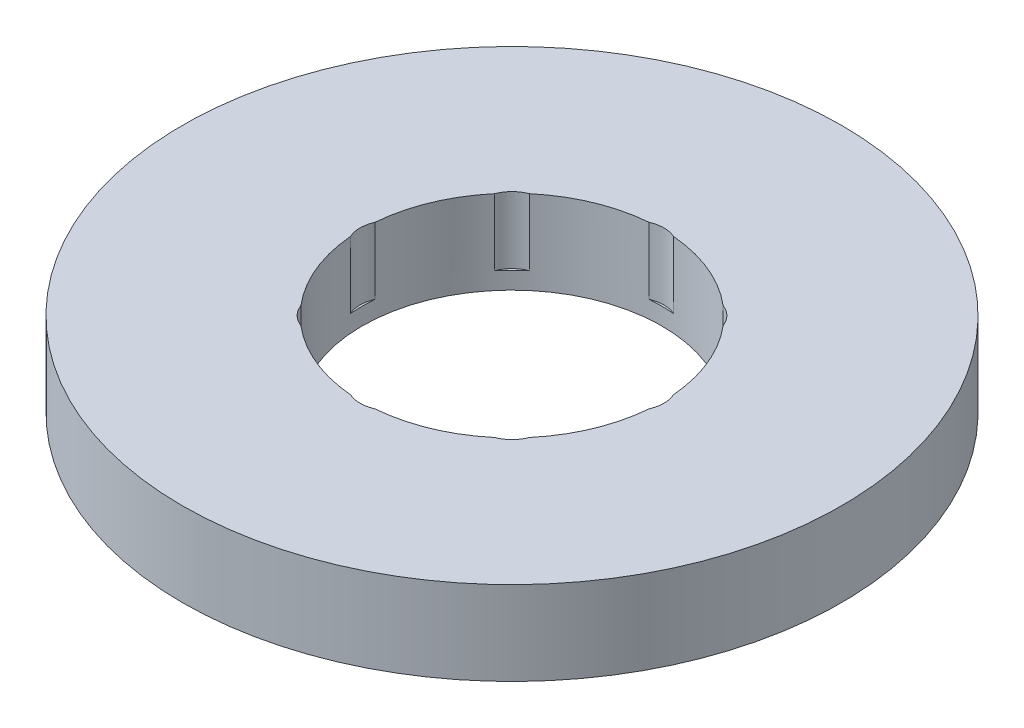
ISO-10303-21;
HEADER;
FILE_DESCRIPTION(('STEP AP214'),'2;1');
FILE_NAME('part.step','',(''),(''),'','','');
FILE_SCHEMA(('AUTOMOTIVE_DESIGN { 1 0 10303 214 1 1 1 1 }'));
ENDSEC;
DATA;
#1=APPLICATION_CONTEXT('core data for automotive mechanical design processes');
#2=APPLICATION_PROTOCOL_DEFINITION('international standard','automotive_design',2000,#1);
#3=PRODUCT_CONTEXT('',#1,'mechanical');
#4=PRODUCT('Part','Part','',(#3));
#5=PRODUCT_RELATED_PRODUCT_CATEGORY('part','',(#4));
#6=PRODUCT_DEFINITION_FORMATION('','',#4);
#7=PRODUCT_DEFINITION_CONTEXT('part definition',#1,'design');
#8=PRODUCT_DEFINITION('design','',#6,#7);
#9=PRODUCT_DEFINITION_SHAPE('','',#8);
#10=(LENGTH_UNIT() NAMED_UNIT(*) SI_UNIT(.MILLI.,.METRE.));
#11=(NAMED_UNIT(*) PLANE_ANGLE_UNIT() SI_UNIT($,.RADIAN.));
#12=(NAMED_UNIT(*) SI_UNIT($,.STERADIAN.) SOLID_ANGLE_UNIT());
#13=UNCERTAINTY_MEASURE_WITH_UNIT(LENGTH_MEASURE(1.E-05),#10,'distance_accuracy_value','');
#14=(GEOMETRIC_REPRESENTATION_CONTEXT(3) GLOBAL_UNCERTAINTY_ASSIGNED_CONTEXT((#13)) GLOBAL_UNIT_ASSIGNED_CONTEXT((#10,
#11,#12)) REPRESENTATION_CONTEXT('',''));
#15=CARTESIAN_POINT('',(0.,0.,0.));
#16=DIRECTION('',(0.,0.,1.));
#17=DIRECTION('',(1.,0.,0.));
#18=AXIS2_PLACEMENT_3D('',#15,#16,#17);
#19=CARTESIAN_POINT('',(0.,21.,0.));
#20=DIRECTION('',(0.,-1.,0.));
#21=DIRECTION('',(0.,0.,-1.));
#22=AXIS2_PLACEMENT_3D('',#19,#20,#21);
#23=CYLINDRICAL_SURFACE('',#22,82.5);
#24=CARTESIAN_POINT('',(0.,21.,0.));
#25=DIRECTION('',(0.,1.,0.));
#26=DIRECTION('',(0.,0.,1.));
#27=AXIS2_PLACEMENT_3D('',#24,#25,#26);
#28=CIRCLE('',#27,82.5);
#29=CARTESIAN_POINT('',(0.,21.,-82.5));
#30=VERTEX_POINT('',#29);
#31=EDGE_CURVE('E183',#30,#30,#28,.T.);
#32=CARTESIAN_POINT('',(0.,0.,0.));
#33=DIRECTION('',(0.,1.,0.));
#34=DIRECTION('',(0.,0.,1.));
#35=AXIS2_PLACEMENT_3D('',#32,#33,#34);
#36=CIRCLE('',#35,82.5);
#37=CARTESIAN_POINT('',(0.,0.,-82.5));
#38=VERTEX_POINT('',#37);
#39=EDGE_CURVE('E182',#38,#38,#36,.T.);
#40=CARTESIAN_POINT('',(0.,21.,-82.5));
#41=CARTESIAN_POINT('',(0.,20.78125,-82.5));
#42=CARTESIAN_POINT('',(0.,20.5625,-82.5));
#43=CARTESIAN_POINT('',(0.,20.125,-82.5));
#44=CARTESIAN_POINT('',(0.,19.90625,-82.5));
#45=CARTESIAN_POINT('',(0.,19.46875,-82.5));
#46=CARTESIAN_POINT('',(0.,19.25,-82.5));
#47=CARTESIAN_POINT('',(0.,18.8125,-82.5));
#48=CARTESIAN_POINT('',(0.,18.59375,-82.5));
#49=CARTESIAN_POINT('',(0.,18.15625,-82.5));
#50=CARTESIAN_POINT('',(0.,17.9375,-82.5));
#51=CARTESIAN_POINT('',(0.,17.5,-82.5));
#52=CARTESIAN_POINT('',(0.,17.28125,-82.5));
#53=CARTESIAN_POINT('',(0.,16.84375,-82.5));
#54=CARTESIAN_POINT('',(0.,16.625,-82.5));
#55=CARTESIAN_POINT('',(0.,16.1875,-82.5));
#56=CARTESIAN_POINT('',(0.,15.96875,-82.5));
#57=CARTESIAN_POINT('',(0.,15.53125,-82.5));
#58=CARTESIAN_POINT('',(0.,15.3125,-82.5));
#59=CARTESIAN_POINT('',(0.,14.875,-82.5));
#60=CARTESIAN_POINT('',(0.,14.65625,-82.5));
#61=CARTESIAN_POINT('',(0.,14.21875,-82.5));
#62=CARTESIAN_POINT('',(0.,14.,-82.5));
#63=CARTESIAN_POINT('',(0.,13.5625,-82.5));
#64=CARTESIAN_POINT('',(0.,13.34375,-82.5));
#65=CARTESIAN_POINT('',(0.,12.90625,-82.5));
#66=CARTESIAN_POINT('',(0.,12.6875,-82.5));
#67=CARTESIAN_POINT('',(0.,12.25,-82.5));
#68=CARTESIAN_POINT('',(0.,12.03125,-82.5));
#69=CARTESIAN_POINT('',(0.,11.59375,-82.5));
#70=CARTESIAN_POINT('',(0.,11.375,-82.5));
#71=CARTESIAN_POINT('',(0.,10.9375,-82.5));
#72=CARTESIAN_POINT('',(0.,10.71875,-82.5));
#73=CARTESIAN_POINT('',(0.,10.28125,-82.5));
#74=CARTESIAN_POINT('',(0.,10.0625,-82.5));
#75=CARTESIAN_POINT('',(0.,9.625,-82.5));
#76=CARTESIAN_POINT('',(0.,9.40625,-82.5));
#77=CARTESIAN_POINT('',(0.,8.96875,-82.5));
#78=CARTESIAN_POINT('',(0.,8.75,-82.5));
#79=CARTESIAN_POINT('',(0.,8.3125,-82.5));
#80=CARTESIAN_POINT('',(0.,8.09375,-82.5));
#81=CARTESIAN_POINT('',(0.,7.65625,-82.5));
#82=CARTESIAN_POINT('',(0.,7.4375,-82.5));
#83=CARTESIAN_POINT('',(0.,7.,-82.5));
#84=CARTESIAN_POINT('',(0.,6.78125,-82.5));
#85=CARTESIAN_POINT('',(0.,6.34375,-82.5));
#86=CARTESIAN_POINT('',(0.,6.125,-82.5));
#87=CARTESIAN_POINT('',(0.,5.6875,-82.5));
#88=CARTESIAN_POINT('',(0.,5.46875,-82.5));
#89=CARTESIAN_POINT('',(0.,5.03125,-82.5));
#90=CARTESIAN_POINT('',(0.,4.8125,-82.5));
#91=CARTESIAN_POINT('',(0.,4.375,-82.5));
#92=CARTESIAN_POINT('',(0.,4.15625,-82.5));
#93=CARTESIAN_POINT('',(0.,3.71875,-82.5));
#94=CARTESIAN_POINT('',(0.,3.5,-82.5));
#95=CARTESIAN_POINT('',(0.,3.0625,-82.5));
#96=CARTESIAN_POINT('',(0.,2.84375,-82.5));
#97=CARTESIAN_POINT('',(0.,2.40625,-82.5));
#98=CARTESIAN_POINT('',(0.,2.1875,-82.5));
#99=CARTESIAN_POINT('',(0.,1.75,-82.5));
#100=CARTESIAN_POINT('',(0.,1.53125,-82.5));
#101=CARTESIAN_POINT('',(0.,1.09375,-82.5));
#102=CARTESIAN_POINT('',(0.,0.875000000000001,-82.5));
#103=CARTESIAN_POINT('',(0.,0.4375,-82.5));
#104=CARTESIAN_POINT('',(0.,0.21875,-82.5));
#105=CARTESIAN_POINT('',(0.,0.,-82.5));
#106=B_SPLINE_CURVE_WITH_KNOTS('',3,(#40,#41,#42,#43,#44,#45,#46,#47,#48,#49,#50,#51,#52,#53,
#54,#55,#56,#57,#58,#59,#60,#61,#62,#63,#64,#65,#66,#67,#68,#69,#70,#71,#72,#73,#74,#75,#76,#77,
#78,#79,#80,#81,#82,#83,#84,#85,#86,#87,#88,#89,#90,#91,#92,#93,#94,#95,#96,#97,#98,#99,#100,
#101,#102,#103,#104,#105),.UNSPECIFIED.,.F.,.F.,(4,2,2,2,2,2,2,2,2,2,2,2,2,2,2,2,2,2,2,2,2,2,2,
2,2,2,2,2,2,2,2,2,4),(0.,0.656249999999997,1.3125,1.96875,2.625,3.28125,3.9375,4.59375,5.25,
5.90625,6.5625,7.21875,7.875,8.53125,9.1875,9.84375,10.5,11.15625,11.8125,12.46875,13.125,
13.78125,14.4375,15.09375,15.75,16.40625,17.0625,17.71875,18.375,19.03125,19.6875,20.34375,21.),.UNSPECIFIED.);
#107=EDGE_CURVE('BSEAM39',#30,#38,#106,.T.);
#108=ORIENTED_EDGE('',*,*,#31,.F.);
#109=ORIENTED_EDGE('',*,*,#39,.T.);
#110=ORIENTED_EDGE('',*,*,#107,.T.);
#111=ORIENTED_EDGE('',*,*,#107,.F.);
#112=EDGE_LOOP('',(#108,#110,#109,#111));
#113=FACE_BOUND('',#112,.T.);
#114=ADVANCED_FACE('F39',(#113),#23,.T.);
#115=CARTESIAN_POINT('',(0.,21.,0.));
#116=DIRECTION('',(0.,1.,0.));
#117=DIRECTION('',(0.,0.,1.));
#118=AXIS2_PLACEMENT_3D('',#115,#116,#117);
#119=PLANE('',#118);
#120=CARTESIAN_POINT('',(1.0660321650107E-13,21.,30.532374701562));
#121=DIRECTION('',(0.,1.,0.));
#122=DIRECTION('',(1.,0.,0.));
#123=AXIS2_PLACEMENT_3D('',#120,#121,#122);
#124=CIRCLE('',#123,7.49857931107928);
#125=CARTESIAN_POINT('',(-3.06885672796474,21.,37.3742172945899));
#126=VERTEX_POINT('',#125);
#127=CARTESIAN_POINT('',(3.06885672796501,21.,37.3742172945899));
#128=VERTEX_POINT('',#127);
#129=EDGE_CURVE('E256',#126,#128,#124,.T.);
#130=ORIENTED_EDGE('',*,*,#129,.F.);
#131=CARTESIAN_POINT('',(0.,21.,0.));
#132=DIRECTION('',(0.,1.,0.));
#133=DIRECTION('',(0.,0.,1.));
#134=AXIS2_PLACEMENT_3D('',#131,#132,#133);
#135=CIRCLE('',#134,37.5);
#136=CARTESIAN_POINT('',(-24.2575530877101,21.,28.5975718933781));
#137=VERTEX_POINT('',#136);
#138=EDGE_CURVE('E175',#137,#126,#135,.T.);
#139=ORIENTED_EDGE('',*,*,#138,.F.);
#140=CARTESIAN_POINT('',(-21.5896491972031,21.,21.5896491972031));
#141=DIRECTION('',(0.,1.,0.));
#142=DIRECTION('',(0.707106781186549,0.,0.707106781186546));
#143=AXIS2_PLACEMENT_3D('',#140,#141,#142);
#144=CIRCLE('',#143,7.49857931107928);
#145=CARTESIAN_POINT('',(-28.597571893378,21.,24.2575530877102));
#146=VERTEX_POINT('',#145);
#147=EDGE_CURVE('E152',#146,#137,#144,.T.);
#148=ORIENTED_EDGE('',*,*,#147,.F.);
#149=CARTESIAN_POINT('',(-37.3742172945899,21.,3.06885672796488));
#150=VERTEX_POINT('',#149);
#151=EDGE_CURVE('E168',#150,#146,#135,.T.);
#152=ORIENTED_EDGE('',*,*,#151,.F.);
#153=CARTESIAN_POINT('',(-30.532374701562,21.,0.));
#154=DIRECTION('',(0.,1.,0.));
#155=DIRECTION('',(0.,0.,1.));
#156=AXIS2_PLACEMENT_3D('',#153,#154,#155);
#157=CIRCLE('',#156,7.49857931107928);
#158=CARTESIAN_POINT('',(-37.3742172945899,21.,-3.06885672796488));
#159=VERTEX_POINT('',#158);
#160=EDGE_CURVE('E205',#159,#150,#157,.T.);
#161=ORIENTED_EDGE('',*,*,#160,.F.);
#162=CARTESIAN_POINT('',(-28.5975718933783,21.,-24.2575530877098));
#163=VERTEX_POINT('',#162);
#164=EDGE_CURVE('E181',#163,#159,#135,.T.);
#165=ORIENTED_EDGE('',*,*,#164,.F.);
#166=CARTESIAN_POINT('',(-21.5896491972034,21.,-21.5896491972028));
#167=DIRECTION('',(0.,1.,0.));
#168=DIRECTION('',(-0.707106781186539,0.,0.707106781186556));
#169=AXIS2_PLACEMENT_3D('',#166,#167,#168);
#170=CIRCLE('',#169,7.49857931107928);
#171=CARTESIAN_POINT('',(-24.2575530877105,21.,-28.5975718933777));
#172=VERTEX_POINT('',#171);
#173=EDGE_CURVE('E453',#172,#163,#170,.T.);
#174=ORIENTED_EDGE('',*,*,#173,.F.);
#175=CARTESIAN_POINT('',(-3.06885672796527,21.,-37.3742172945899));
#176=VERTEX_POINT('',#175);
#177=EDGE_CURVE('E189',#176,#172,#135,.T.);
#178=ORIENTED_EDGE('',*,*,#177,.F.);
#179=CARTESIAN_POINT('',(-3.1980964950321E-13,21.,-30.532374701562));
#180=DIRECTION('',(0.,1.,0.));
#181=DIRECTION('',(-1.,0.,0.));
#182=AXIS2_PLACEMENT_3D('',#179,#180,#181);
#183=CIRCLE('',#182,7.49857931107928);
#184=CARTESIAN_POINT('',(3.06885672796448,21.,-37.37421729459));
#185=VERTEX_POINT('',#184);
#186=EDGE_CURVE('E462',#185,#176,#183,.T.);
#187=ORIENTED_EDGE('',*,*,#186,.F.);
#188=CARTESIAN_POINT('',(24.2575530877099,21.,-28.5975718933782));
#189=VERTEX_POINT('',#188);
#190=EDGE_CURVE('E197',#189,#185,#135,.T.);
#191=ORIENTED_EDGE('',*,*,#190,.F.);
#192=CARTESIAN_POINT('',(21.5896491972029,21.,-21.5896491972033));
#193=DIRECTION('',(0.,1.,0.));
#194=DIRECTION('',(-0.707106781186554,0.,-0.707106781186541));
#195=AXIS2_PLACEMENT_3D('',#192,#193,#194);
#196=CIRCLE('',#195,7.49857931107928);
#197=CARTESIAN_POINT('',(28.5975718933778,21.,-24.2575530877104));
#198=VERTEX_POINT('',#197);
#199=EDGE_CURVE('E470',#198,#189,#196,.T.);
#200=ORIENTED_EDGE('',*,*,#199,.F.);
#201=CARTESIAN_POINT('',(37.3742172945899,21.,-3.06885672796488));
#202=VERTEX_POINT('',#201);
#203=EDGE_CURVE('E489',#202,#198,#135,.T.);
#204=ORIENTED_EDGE('',*,*,#203,.F.);
#205=CARTESIAN_POINT('',(30.532374701562,21.,0.));
#206=DIRECTION('',(0.,1.,0.));
#207=DIRECTION('',(0.,0.,-1.));
#208=AXIS2_PLACEMENT_3D('',#205,#206,#207);
#209=CIRCLE('',#208,7.49857931107928);
#210=CARTESIAN_POINT('',(37.3742172945899,21.,3.06885672796488));
#211=VERTEX_POINT('',#210);
#212=EDGE_CURVE('E476',#211,#202,#209,.T.);
#213=ORIENTED_EDGE('',*,*,#212,.F.);
#214=CARTESIAN_POINT('',(28.5975718933781,21.,24.25755308771));
#215=VERTEX_POINT('',#214);
#216=EDGE_CURVE('E491',#215,#211,#135,.T.);
#217=ORIENTED_EDGE('',*,*,#216,.F.);
#218=CARTESIAN_POINT('',(21.5896491972032,21.,21.589649197203));
#219=DIRECTION('',(0.,1.,0.));
#220=DIRECTION('',(0.707106781186544,0.,-0.707106781186551));
#221=AXIS2_PLACEMENT_3D('',#218,#219,#220);
#222=CIRCLE('',#221,7.49857931107928);
#223=CARTESIAN_POINT('',(24.2575530877103,21.,28.5975718933779));
#224=VERTEX_POINT('',#223);
#225=EDGE_CURVE('E475',#224,#215,#222,.T.);
#226=ORIENTED_EDGE('',*,*,#225,.F.);
#227=EDGE_CURVE('E190',#128,#224,#135,.T.);
#228=ORIENTED_EDGE('',*,*,#227,.F.);
#229=EDGE_LOOP('',(#130,#139,#148,#152,#161,#165,#174,#178,#187,#191,#200,#204,#213,#217,#226,#228));
#230=FACE_BOUND('',#229,.T.);
#231=ORIENTED_EDGE('',*,*,#31,.T.);
#232=EDGE_LOOP('',(#231));
#233=FACE_BOUND('',#232,.T.);
#234=ADVANCED_FACE('F170',(#230,#233),#119,.T.);
#235=CARTESIAN_POINT('',(0.,0.,0.));
#236=DIRECTION('',(0.,1.,0.));
#237=DIRECTION('',(0.,0.,1.));
#238=AXIS2_PLACEMENT_3D('',#235,#236,#237);
#239=PLANE('',#238);
#240=CARTESIAN_POINT('',(0.,0.,0.));
#241=DIRECTION('',(0.,1.,0.));
#242=DIRECTION('',(0.,0.,1.));
#243=AXIS2_PLACEMENT_3D('',#240,#241,#242);
#244=CIRCLE('',#243,37.5);
#245=CARTESIAN_POINT('',(0.,0.,37.5));
#246=VERTEX_POINT('',#245);
#247=EDGE_CURVE('E191',#246,#246,#244,.T.);
#248=ORIENTED_EDGE('',*,*,#247,.T.);
#249=EDGE_LOOP('',(#248));
#250=FACE_BOUND('',#249,.T.);
#251=ORIENTED_EDGE('',*,*,#39,.F.);
#252=EDGE_LOOP('',(#251));
#253=FACE_BOUND('',#252,.T.);
#254=ADVANCED_FACE('F277',(#250,#253),#239,.F.);
#255=CARTESIAN_POINT('',(0.,21.,0.));
#256=DIRECTION('',(0.,-1.,0.));
#257=DIRECTION('',(0.,0.,-1.));
#258=AXIS2_PLACEMENT_3D('',#255,#256,#257);
#259=CYLINDRICAL_SURFACE('',#258,37.5);
#260=DIRECTION('',(0.,1.,0.));
#261=VECTOR('',#260,1.);
#262=CARTESIAN_POINT('',(-3.06885672796475,12.6460359273784,37.3742172945899));
#263=LINE('',#262,#261);
#264=CARTESIAN_POINT('',(-3.06885672796474,4.29207185475679,37.3742172945899));
#265=VERTEX_POINT('',#264);
#266=EDGE_CURVE('E11',#265,#126,#263,.T.);
#267=ORIENTED_EDGE('',*,*,#266,.F.);
#268=CARTESIAN_POINT('',(0.,4.29207185475679,0.));
#269=DIRECTION('',(0.,1.,0.));
#270=DIRECTION('',(0.,0.,1.));
#271=AXIS2_PLACEMENT_3D('',#268,#269,#270);
#272=CIRCLE('',#271,37.5);
#273=CARTESIAN_POINT('',(3.06885672796501,4.29207185475679,37.3742172945899));
#274=VERTEX_POINT('',#273);
#275=EDGE_CURVE('E251',#265,#274,#272,.T.);
#276=ORIENTED_EDGE('',*,*,#275,.T.);
#277=DIRECTION('',(0.,1.,0.));
#278=VECTOR('',#277,1.);
#279=CARTESIAN_POINT('',(3.06885672796501,12.6460359273784,37.3742172945899));
#280=LINE('',#279,#278);
#281=EDGE_CURVE('E46',#128,#274,#280,.F.);
#282=ORIENTED_EDGE('',*,*,#281,.F.);
#283=ORIENTED_EDGE('',*,*,#227,.T.);
#284=DIRECTION('',(0.,1.,0.));
#285=VECTOR('',#284,1.);
#286=CARTESIAN_POINT('',(24.2575530877103,12.6460359273784,28.5975718933779));
#287=LINE('',#286,#285);
#288=CARTESIAN_POINT('',(24.2575530877103,4.29207185475679,28.5975718933779));
#289=VERTEX_POINT('',#288);
#290=EDGE_CURVE('E253',#289,#224,#287,.T.);
#291=ORIENTED_EDGE('',*,*,#290,.F.);
#292=CARTESIAN_POINT('',(0.,4.29207185475679,0.));
#293=DIRECTION('',(0.,1.,0.));
#294=DIRECTION('',(0.,0.,1.));
#295=AXIS2_PLACEMENT_3D('',#292,#293,#294);
#296=CIRCLE('',#295,37.5);
#297=CARTESIAN_POINT('',(28.5975718933781,4.29207185475679,24.25755308771));
#298=VERTEX_POINT('',#297);
#299=EDGE_CURVE('E246',#289,#298,#296,.T.);
#300=ORIENTED_EDGE('',*,*,#299,.T.);
#301=DIRECTION('',(0.,1.,0.));
#302=VECTOR('',#301,1.);
#303=CARTESIAN_POINT('',(28.5975718933781,12.6460359273784,24.25755308771));
#304=LINE('',#303,#302);
#305=EDGE_CURVE('E248',#215,#298,#304,.F.);
#306=ORIENTED_EDGE('',*,*,#305,.F.);
#307=ORIENTED_EDGE('',*,*,#216,.T.);
#308=DIRECTION('',(0.,1.,0.));
#309=VECTOR('',#308,1.);
#310=CARTESIAN_POINT('',(37.3742172945899,12.6460359273784,3.06885672796488));
#311=LINE('',#310,#309);
#312=CARTESIAN_POINT('',(37.3742172945899,4.29207185475679,3.06885672796488));
#313=VERTEX_POINT('',#312);
#314=EDGE_CURVE('E243',#313,#211,#311,.T.);
#315=ORIENTED_EDGE('',*,*,#314,.F.);
#316=CARTESIAN_POINT('',(0.,4.29207185475679,0.));
#317=DIRECTION('',(0.,1.,0.));
#318=DIRECTION('',(0.,0.,1.));
#319=AXIS2_PLACEMENT_3D('',#316,#317,#318);
#320=CIRCLE('',#319,37.5);
#321=CARTESIAN_POINT('',(37.3742172945899,4.29207185475679,-3.06885672796488));
#322=VERTEX_POINT('',#321);
#323=EDGE_CURVE('E236',#313,#322,#320,.T.);
#324=ORIENTED_EDGE('',*,*,#323,.T.);
#325=DIRECTION('',(0.,1.,0.));
#326=VECTOR('',#325,1.);
#327=CARTESIAN_POINT('',(37.3742172945899,12.6460359273784,-3.06885672796488));
#328=LINE('',#327,#326);
#329=EDGE_CURVE('E241',#202,#322,#328,.F.);
#330=ORIENTED_EDGE('',*,*,#329,.F.);
#331=ORIENTED_EDGE('',*,*,#203,.T.);
#332=DIRECTION('',(0.,1.,0.));
#333=VECTOR('',#332,1.);
#334=CARTESIAN_POINT('',(28.5975718933778,12.6460359273784,-24.2575530877104));
#335=LINE('',#334,#333);
#336=CARTESIAN_POINT('',(28.5975718933778,4.29207185475679,-24.2575530877104));
#337=VERTEX_POINT('',#336);
#338=EDGE_CURVE('E237',#337,#198,#335,.T.);
#339=ORIENTED_EDGE('',*,*,#338,.F.);
#340=CARTESIAN_POINT('',(0.,4.29207185475679,0.));
#341=DIRECTION('',(0.,1.,0.));
#342=DIRECTION('',(0.,0.,1.));
#343=AXIS2_PLACEMENT_3D('',#340,#341,#342);
#344=CIRCLE('',#343,37.5);
#345=CARTESIAN_POINT('',(24.2575530877099,4.29207185475679,-28.5975718933782));
#346=VERTEX_POINT('',#345);
#347=EDGE_CURVE('E229',#337,#346,#344,.T.);
#348=ORIENTED_EDGE('',*,*,#347,.T.);
#349=DIRECTION('',(0.,1.,0.));
#350=VECTOR('',#349,1.);
#351=CARTESIAN_POINT('',(24.2575530877099,12.6460359273784,-28.5975718933782));
#352=LINE('',#351,#350);
#353=EDGE_CURVE('E232',#189,#346,#352,.F.);
#354=ORIENTED_EDGE('',*,*,#353,.F.);
#355=ORIENTED_EDGE('',*,*,#190,.T.);
#356=DIRECTION('',(0.,1.,0.));
#357=VECTOR('',#356,1.);
#358=CARTESIAN_POINT('',(3.06885672796449,12.6460359273784,-37.37421729459));
#359=LINE('',#358,#357);
#360=CARTESIAN_POINT('',(3.06885672796448,4.29207185475679,-37.37421729459));
#361=VERTEX_POINT('',#360);
#362=EDGE_CURVE('E227',#361,#185,#359,.T.);
#363=ORIENTED_EDGE('',*,*,#362,.F.);
#364=CARTESIAN_POINT('',(0.,4.29207185475679,0.));
#365=DIRECTION('',(0.,1.,0.));
#366=DIRECTION('',(0.,0.,1.));
#367=AXIS2_PLACEMENT_3D('',#364,#365,#366);
#368=CIRCLE('',#367,37.5);
#369=CARTESIAN_POINT('',(-3.06885672796527,4.29207185475679,-37.3742172945899));
#370=VERTEX_POINT('',#369);
#371=EDGE_CURVE('E225',#361,#370,#368,.T.);
#372=ORIENTED_EDGE('',*,*,#371,.T.);
#373=DIRECTION('',(0.,1.,0.));
#374=VECTOR('',#373,1.);
#375=CARTESIAN_POINT('',(-3.06885672796527,12.6460359273784,-37.3742172945899));
#376=LINE('',#375,#374);
#377=EDGE_CURVE('E223',#176,#370,#376,.F.);
#378=ORIENTED_EDGE('',*,*,#377,.F.);
#379=ORIENTED_EDGE('',*,*,#177,.T.);
#380=DIRECTION('',(0.,1.,0.));
#381=VECTOR('',#380,1.);
#382=CARTESIAN_POINT('',(-24.2575530877105,12.6460359273784,-28.5975718933777));
#383=LINE('',#382,#381);
#384=CARTESIAN_POINT('',(-24.2575530877105,4.29207185475679,-28.5975718933777));
#385=VERTEX_POINT('',#384);
#386=EDGE_CURVE('E219',#385,#172,#383,.T.);
#387=ORIENTED_EDGE('',*,*,#386,.F.);
#388=CARTESIAN_POINT('',(0.,4.29207185475679,0.));
#389=DIRECTION('',(0.,1.,0.));
#390=DIRECTION('',(0.,0.,1.));
#391=AXIS2_PLACEMENT_3D('',#388,#389,#390);
#392=CIRCLE('',#391,37.5);
#393=CARTESIAN_POINT('',(-28.5975718933783,4.29207185475679,-24.2575530877098));
#394=VERTEX_POINT('',#393);
#395=EDGE_CURVE('E159',#385,#394,#392,.T.);
#396=ORIENTED_EDGE('',*,*,#395,.T.);
#397=DIRECTION('',(0.,1.,0.));
#398=VECTOR('',#397,1.);
#399=CARTESIAN_POINT('',(-28.5975718933783,12.6460359273784,-24.2575530877098));
#400=LINE('',#399,#398);
#401=EDGE_CURVE('E220',#163,#394,#400,.F.);
#402=ORIENTED_EDGE('',*,*,#401,.F.);
#403=ORIENTED_EDGE('',*,*,#164,.T.);
#404=DIRECTION('',(0.,1.,0.));
#405=VECTOR('',#404,1.);
#406=CARTESIAN_POINT('',(-37.3742172945899,12.6460359273784,-3.06885672796488));
#407=LINE('',#406,#405);
#408=CARTESIAN_POINT('',(-37.3742172945899,4.29207185475679,-3.06885672796488));
#409=VERTEX_POINT('',#408);
#410=EDGE_CURVE('E209',#409,#159,#407,.T.);
#411=ORIENTED_EDGE('',*,*,#410,.F.);
#412=CARTESIAN_POINT('',(0.,4.29207185475679,0.));
#413=DIRECTION('',(0.,1.,0.));
#414=DIRECTION('',(0.,0.,1.));
#415=AXIS2_PLACEMENT_3D('',#412,#413,#414);
#416=CIRCLE('',#415,37.5);
#417=CARTESIAN_POINT('',(-37.3742172945899,4.29207185475679,3.06885672796488));
#418=VERTEX_POINT('',#417);
#419=EDGE_CURVE('E206',#409,#418,#416,.T.);
#420=ORIENTED_EDGE('',*,*,#419,.T.);
#421=DIRECTION('',(0.,1.,0.));
#422=VECTOR('',#421,1.);
#423=CARTESIAN_POINT('',(-37.3742172945899,12.6460359273784,3.06885672796488));
#424=LINE('',#423,#422);
#425=EDGE_CURVE('E179',#150,#418,#424,.F.);
#426=ORIENTED_EDGE('',*,*,#425,.F.);
#427=ORIENTED_EDGE('',*,*,#151,.T.);
#428=DIRECTION('',(0.,1.,0.));
#429=VECTOR('',#428,1.);
#430=CARTESIAN_POINT('',(-28.597571893378,12.6460359273784,24.2575530877102));
#431=LINE('',#430,#429);
#432=CARTESIAN_POINT('',(-28.597571893378,4.29207185475679,24.2575530877102));
#433=VERTEX_POINT('',#432);
#434=EDGE_CURVE('E147',#433,#146,#431,.T.);
#435=ORIENTED_EDGE('',*,*,#434,.F.);
#436=CARTESIAN_POINT('',(0.,4.29207185475679,0.));
#437=DIRECTION('',(0.,1.,0.));
#438=DIRECTION('',(0.,0.,1.));
#439=AXIS2_PLACEMENT_3D('',#436,#437,#438);
#440=CIRCLE('',#439,37.5);
#441=CARTESIAN_POINT('',(-24.2575530877101,4.29207185475679,28.5975718933781));
#442=VERTEX_POINT('',#441);
#443=EDGE_CURVE('E215',#433,#442,#440,.T.);
#444=ORIENTED_EDGE('',*,*,#443,.T.);
#445=DIRECTION('',(0.,1.,0.));
#446=VECTOR('',#445,1.);
#447=CARTESIAN_POINT('',(-24.2575530877101,12.6460359273784,28.597571893378));
#448=LINE('',#447,#446);
#449=EDGE_CURVE('E161',#137,#442,#448,.F.);
#450=ORIENTED_EDGE('',*,*,#449,.F.);
#451=ORIENTED_EDGE('',*,*,#138,.T.);
#452=EDGE_LOOP('',(#267,#276,#282,#283,#291,#300,#306,#307,#315,#324,#330,#331,#339,#348,#354,
#355,#363,#372,#378,#379,#387,#396,#402,#403,#411,#420,#426,#427,#435,#444,#450,#451));
#453=FACE_BOUND('',#452,.T.);
#454=ORIENTED_EDGE('',*,*,#247,.F.);
#455=EDGE_LOOP('',(#454));
#456=FACE_BOUND('',#455,.T.);
#457=ADVANCED_FACE('F176',(#453,#456),#259,.F.);
#458=CARTESIAN_POINT('',(-30.532374701562,4.29207185475679,0.));
#459=DIRECTION('',(0.,1.,0.));
#460=DIRECTION('',(0.,0.,1.));
#461=AXIS2_PLACEMENT_3D('',#458,#459,#460);
#462=CYLINDRICAL_SURFACE('',#461,7.49857931107928);
#463=ORIENTED_EDGE('',*,*,#410,.T.);
#464=ORIENTED_EDGE('',*,*,#160,.T.);
#465=ORIENTED_EDGE('',*,*,#425,.T.);
#466=CARTESIAN_POINT('',(-30.532374701562,4.29207185475679,0.));
#467=DIRECTION('',(0.,1.,0.));
#468=DIRECTION('',(0.,0.,1.));
#469=AXIS2_PLACEMENT_3D('',#466,#467,#468);
#470=CIRCLE('',#469,7.49857931107928);
#471=EDGE_CURVE('E200',#409,#418,#470,.T.);
#472=ORIENTED_EDGE('',*,*,#471,.F.);
#473=EDGE_LOOP('',(#463,#464,#465,#472));
#474=FACE_BOUND('',#473,.T.);
#475=ADVANCED_FACE('F286',(#474),#462,.F.);
#476=CARTESIAN_POINT('',(-30.532374701562,4.29207185475679,0.));
#477=DIRECTION('',(0.,1.,0.));
#478=DIRECTION('',(0.,0.,1.));
#479=AXIS2_PLACEMENT_3D('',#476,#477,#478);
#480=PLANE('',#479);
#481=ORIENTED_EDGE('',*,*,#471,.T.);
#482=ORIENTED_EDGE('',*,*,#419,.F.);
#483=EDGE_LOOP('',(#481,#482));
#484=FACE_BOUND('',#483,.T.);
#485=ADVANCED_FACE('F289',(#484),#480,.T.);
#486=CARTESIAN_POINT('',(-21.5896491972031,4.29207185475679,21.5896491972031));
#487=DIRECTION('',(0.,1.,0.));
#488=DIRECTION('',(0.,0.,1.));
#489=AXIS2_PLACEMENT_3D('',#486,#487,#488);
#490=CYLINDRICAL_SURFACE('',#489,7.49857931107928);
#491=ORIENTED_EDGE('',*,*,#434,.T.);
#492=ORIENTED_EDGE('',*,*,#147,.T.);
#493=ORIENTED_EDGE('',*,*,#449,.T.);
#494=CARTESIAN_POINT('',(-21.5896491972031,4.29207185475679,21.5896491972031));
#495=DIRECTION('',(0.,1.,0.));
#496=DIRECTION('',(0.707106781186549,0.,0.707106781186546));
#497=AXIS2_PLACEMENT_3D('',#494,#495,#496);
#498=CIRCLE('',#497,7.49857931107928);
#499=EDGE_CURVE('E156',#433,#442,#498,.T.);
#500=ORIENTED_EDGE('',*,*,#499,.F.);
#501=EDGE_LOOP('',(#491,#492,#493,#500));
#502=FACE_BOUND('',#501,.T.);
#503=ADVANCED_FACE('F155',(#502),#490,.F.);
#504=CARTESIAN_POINT('',(-21.5896491972031,4.29207185475679,21.5896491972031));
#505=DIRECTION('',(0.,1.,0.));
#506=DIRECTION('',(0.707106781186549,0.,0.707106781186546));
#507=AXIS2_PLACEMENT_3D('',#504,#505,#506);
#508=PLANE('',#507);
#509=ORIENTED_EDGE('',*,*,#499,.T.);
#510=ORIENTED_EDGE('',*,*,#443,.F.);
#511=EDGE_LOOP('',(#509,#510));
#512=FACE_BOUND('',#511,.T.);
#513=ADVANCED_FACE('F300',(#512),#508,.T.);
#514=CARTESIAN_POINT('',(-21.5896491972034,4.29207185475679,-21.5896491972028));
#515=DIRECTION('',(0.,1.,0.));
#516=DIRECTION('',(0.,0.,1.));
#517=AXIS2_PLACEMENT_3D('',#514,#515,#516);
#518=CYLINDRICAL_SURFACE('',#517,7.49857931107928);
#519=ORIENTED_EDGE('',*,*,#386,.T.);
#520=ORIENTED_EDGE('',*,*,#173,.T.);
#521=ORIENTED_EDGE('',*,*,#401,.T.);
#522=CARTESIAN_POINT('',(-21.5896491972034,4.29207185475679,-21.5896491972028));
#523=DIRECTION('',(0.,1.,0.));
#524=DIRECTION('',(-0.707106781186539,0.,0.707106781186556));
#525=AXIS2_PLACEMENT_3D('',#522,#523,#524);
#526=CIRCLE('',#525,7.49857931107928);
#527=EDGE_CURVE('E454',#385,#394,#526,.T.);
#528=ORIENTED_EDGE('',*,*,#527,.F.);
#529=EDGE_LOOP('',(#519,#520,#521,#528));
#530=FACE_BOUND('',#529,.T.);
#531=ADVANCED_FACE('F299',(#530),#518,.F.);
#532=CARTESIAN_POINT('',(-21.5896491972034,4.29207185475679,-21.5896491972028));
#533=DIRECTION('',(0.,1.,0.));
#534=DIRECTION('',(-0.707106781186539,0.,0.707106781186556));
#535=AXIS2_PLACEMENT_3D('',#532,#533,#534);
#536=PLANE('',#535);
#537=ORIENTED_EDGE('',*,*,#527,.T.);
#538=ORIENTED_EDGE('',*,*,#395,.F.);
#539=EDGE_LOOP('',(#537,#538));
#540=FACE_BOUND('',#539,.T.);
#541=ADVANCED_FACE('F379',(#540),#536,.T.);
#542=CARTESIAN_POINT('',(-3.1980964950321E-13,4.29207185475679,-30.532374701562));
#543=DIRECTION('',(0.,1.,0.));
#544=DIRECTION('',(0.,0.,1.));
#545=AXIS2_PLACEMENT_3D('',#542,#543,#544);
#546=CYLINDRICAL_SURFACE('',#545,7.49857931107928);
#547=ORIENTED_EDGE('',*,*,#362,.T.);
#548=ORIENTED_EDGE('',*,*,#186,.T.);
#549=ORIENTED_EDGE('',*,*,#377,.T.);
#550=CARTESIAN_POINT('',(-3.1980964950321E-13,4.29207185475679,-30.532374701562));
#551=DIRECTION('',(0.,1.,0.));
#552=DIRECTION('',(-1.,0.,0.));
#553=AXIS2_PLACEMENT_3D('',#550,#551,#552);
#554=CIRCLE('',#553,7.49857931107928);
#555=EDGE_CURVE('E465',#361,#370,#554,.T.);
#556=ORIENTED_EDGE('',*,*,#555,.F.);
#557=EDGE_LOOP('',(#547,#548,#549,#556));
#558=FACE_BOUND('',#557,.T.);
#559=ADVANCED_FACE('F371',(#558),#546,.F.);
#560=CARTESIAN_POINT('',(-3.1980964950321E-13,4.29207185475679,-30.532374701562));
#561=DIRECTION('',(0.,1.,0.));
#562=DIRECTION('',(-1.,0.,0.));
#563=AXIS2_PLACEMENT_3D('',#560,#561,#562);
#564=PLANE('',#563);
#565=ORIENTED_EDGE('',*,*,#555,.T.);
#566=ORIENTED_EDGE('',*,*,#371,.F.);
#567=EDGE_LOOP('',(#565,#566));
#568=FACE_BOUND('',#567,.T.);
#569=ADVANCED_FACE('F308',(#568),#564,.T.);
#570=CARTESIAN_POINT('',(21.5896491972029,4.29207185475679,-21.5896491972033));
#571=DIRECTION('',(0.,1.,0.));
#572=DIRECTION('',(0.,0.,1.));
#573=AXIS2_PLACEMENT_3D('',#570,#571,#572);
#574=CYLINDRICAL_SURFACE('',#573,7.49857931107928);
#575=ORIENTED_EDGE('',*,*,#338,.T.);
#576=ORIENTED_EDGE('',*,*,#199,.T.);
#577=ORIENTED_EDGE('',*,*,#353,.T.);
#578=CARTESIAN_POINT('',(21.5896491972029,4.29207185475679,-21.5896491972033));
#579=DIRECTION('',(0.,1.,0.));
#580=DIRECTION('',(-0.707106781186554,0.,-0.707106781186541));
#581=AXIS2_PLACEMENT_3D('',#578,#579,#580);
#582=CIRCLE('',#581,7.49857931107928);
#583=EDGE_CURVE('E477',#337,#346,#582,.T.);
#584=ORIENTED_EDGE('',*,*,#583,.F.);
#585=EDGE_LOOP('',(#575,#576,#577,#584));
#586=FACE_BOUND('',#585,.T.);
#587=ADVANCED_FACE('F305',(#586),#574,.F.);
#588=CARTESIAN_POINT('',(21.5896491972029,4.29207185475679,-21.5896491972033));
#589=DIRECTION('',(0.,1.,0.));
#590=DIRECTION('',(-0.707106781186554,0.,-0.707106781186541));
#591=AXIS2_PLACEMENT_3D('',#588,#589,#590);
#592=PLANE('',#591);
#593=ORIENTED_EDGE('',*,*,#583,.T.);
#594=ORIENTED_EDGE('',*,*,#347,.F.);
#595=EDGE_LOOP('',(#593,#594));
#596=FACE_BOUND('',#595,.T.);
#597=ADVANCED_FACE('F304',(#596),#592,.T.);
#598=CARTESIAN_POINT('',(30.532374701562,4.29207185475679,0.));
#599=DIRECTION('',(0.,1.,0.));
#600=DIRECTION('',(0.,0.,1.));
#601=AXIS2_PLACEMENT_3D('',#598,#599,#600);
#602=CYLINDRICAL_SURFACE('',#601,7.49857931107928);
#603=ORIENTED_EDGE('',*,*,#314,.T.);
#604=ORIENTED_EDGE('',*,*,#212,.T.);
#605=ORIENTED_EDGE('',*,*,#329,.T.);
#606=CARTESIAN_POINT('',(30.532374701562,4.29207185475679,0.));
#607=DIRECTION('',(0.,1.,0.));
#608=DIRECTION('',(0.,0.,-1.));
#609=AXIS2_PLACEMENT_3D('',#606,#607,#608);
#610=CIRCLE('',#609,7.49857931107928);
#611=EDGE_CURVE('E478',#313,#322,#610,.T.);
#612=ORIENTED_EDGE('',*,*,#611,.F.);
#613=EDGE_LOOP('',(#603,#604,#605,#612));
#614=FACE_BOUND('',#613,.T.);
#615=ADVANCED_FACE('F309',(#614),#602,.F.);
#616=CARTESIAN_POINT('',(30.532374701562,4.29207185475679,0.));
#617=DIRECTION('',(0.,1.,0.));
#618=DIRECTION('',(0.,0.,-1.));
#619=AXIS2_PLACEMENT_3D('',#616,#617,#618);
#620=PLANE('',#619);
#621=ORIENTED_EDGE('',*,*,#611,.T.);
#622=ORIENTED_EDGE('',*,*,#323,.F.);
#623=EDGE_LOOP('',(#621,#622));
#624=FACE_BOUND('',#623,.T.);
#625=ADVANCED_FACE('F314',(#624),#620,.T.);
#626=CARTESIAN_POINT('',(21.5896491972032,4.29207185475679,21.589649197203));
#627=DIRECTION('',(0.,1.,0.));
#628=DIRECTION('',(0.,0.,1.));
#629=AXIS2_PLACEMENT_3D('',#626,#627,#628);
#630=CYLINDRICAL_SURFACE('',#629,7.49857931107928);
#631=ORIENTED_EDGE('',*,*,#290,.T.);
#632=ORIENTED_EDGE('',*,*,#225,.T.);
#633=ORIENTED_EDGE('',*,*,#305,.T.);
#634=CARTESIAN_POINT('',(21.5896491972032,4.29207185475679,21.589649197203));
#635=DIRECTION('',(0.,1.,0.));
#636=DIRECTION('',(0.707106781186544,0.,-0.707106781186551));
#637=AXIS2_PLACEMENT_3D('',#634,#635,#636);
#638=CIRCLE('',#637,7.49857931107928);
#639=EDGE_CURVE('E56',#289,#298,#638,.T.);
#640=ORIENTED_EDGE('',*,*,#639,.F.);
#641=EDGE_LOOP('',(#631,#632,#633,#640));
#642=FACE_BOUND('',#641,.T.);
#643=ADVANCED_FACE('F318',(#642),#630,.F.);
#644=CARTESIAN_POINT('',(21.5896491972032,4.29207185475679,21.589649197203));
#645=DIRECTION('',(0.,1.,0.));
#646=DIRECTION('',(0.707106781186544,0.,-0.707106781186551));
#647=AXIS2_PLACEMENT_3D('',#644,#645,#646);
#648=PLANE('',#647);
#649=ORIENTED_EDGE('',*,*,#639,.T.);
#650=ORIENTED_EDGE('',*,*,#299,.F.);
#651=EDGE_LOOP('',(#649,#650));
#652=FACE_BOUND('',#651,.T.);
#653=ADVANCED_FACE('F270',(#652),#648,.T.);
#654=CARTESIAN_POINT('',(1.0660321650107E-13,4.29207185475679,30.532374701562));
#655=DIRECTION('',(0.,1.,0.));
#656=DIRECTION('',(0.,0.,1.));
#657=AXIS2_PLACEMENT_3D('',#654,#655,#656);
#658=CYLINDRICAL_SURFACE('',#657,7.49857931107928);
#659=ORIENTED_EDGE('',*,*,#266,.T.);
#660=ORIENTED_EDGE('',*,*,#129,.T.);
#661=ORIENTED_EDGE('',*,*,#281,.T.);
#662=CARTESIAN_POINT('',(1.0660321650107E-13,4.29207185475679,30.532374701562));
#663=DIRECTION('',(0.,1.,0.));
#664=DIRECTION('',(1.,0.,0.));
#665=AXIS2_PLACEMENT_3D('',#662,#663,#664);
#666=CIRCLE('',#665,7.49857931107928);
#667=EDGE_CURVE('E55',#265,#274,#666,.T.);
#668=ORIENTED_EDGE('',*,*,#667,.F.);
#669=EDGE_LOOP('',(#659,#660,#661,#668));
#670=FACE_BOUND('',#669,.T.);
#671=ADVANCED_FACE('F260',(#670),#658,.F.);
#672=CARTESIAN_POINT('',(1.0660321650107E-13,4.29207185475679,30.532374701562));
#673=DIRECTION('',(0.,1.,0.));
#674=DIRECTION('',(1.,0.,0.));
#675=AXIS2_PLACEMENT_3D('',#672,#673,#674);
#676=PLANE('',#675);
#677=ORIENTED_EDGE('',*,*,#667,.T.);
#678=ORIENTED_EDGE('',*,*,#275,.F.);
#679=EDGE_LOOP('',(#677,#678));
#680=FACE_BOUND('',#679,.T.);
#681=ADVANCED_FACE('F261',(#680),#676,.T.);
#682=CLOSED_SHELL('',(#114,#234,#254,#457,#475,#485,#503,#513,#531,#541,#559,#569,#587,#597,
#615,#625,#643,#653,#671,#681));
#683=MANIFOLD_SOLID_BREP('B2',#682);
#684=ADVANCED_BREP_SHAPE_REPRESENTATION('',(#18,#683),#14);
#685=SHAPE_DEFINITION_REPRESENTATION(#9,#684);
ENDSEC;
END-ISO-10303-21;
